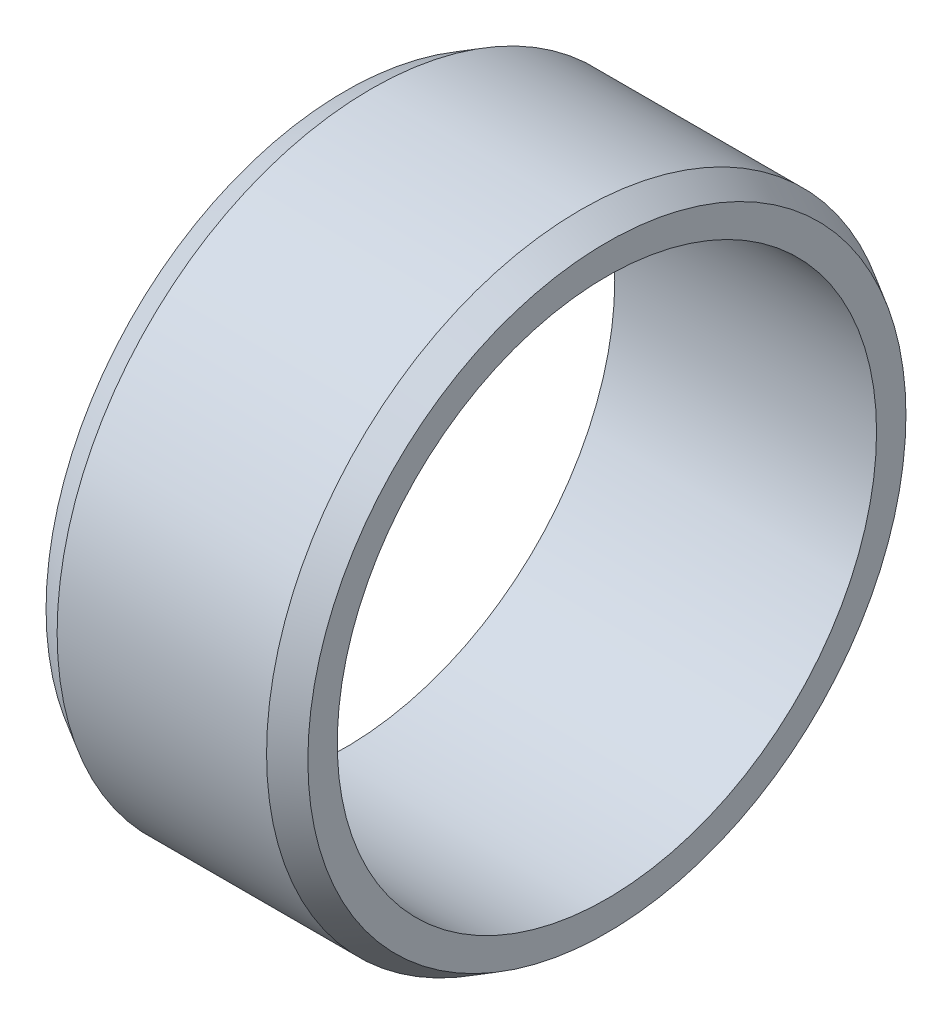
ISO-10303-21;
HEADER;
FILE_DESCRIPTION(('STEP AP214'),'2;1');
FILE_NAME('part.step','',(''),(''),'','','');
FILE_SCHEMA(('AUTOMOTIVE_DESIGN { 1 0 10303 214 1 1 1 1 }'));
ENDSEC;
DATA;
#1=APPLICATION_CONTEXT('core data for automotive mechanical design processes');
#2=APPLICATION_PROTOCOL_DEFINITION('international standard','automotive_design',2000,#1);
#3=PRODUCT_CONTEXT('',#1,'mechanical');
#4=PRODUCT('Part','Part','',(#3));
#5=PRODUCT_RELATED_PRODUCT_CATEGORY('part','',(#4));
#6=PRODUCT_DEFINITION_FORMATION('','',#4);
#7=PRODUCT_DEFINITION_CONTEXT('part definition',#1,'design');
#8=PRODUCT_DEFINITION('design','',#6,#7);
#9=PRODUCT_DEFINITION_SHAPE('','',#8);
#10=(LENGTH_UNIT() NAMED_UNIT(*) SI_UNIT(.MILLI.,.METRE.));
#11=(NAMED_UNIT(*) PLANE_ANGLE_UNIT() SI_UNIT($,.RADIAN.));
#12=(NAMED_UNIT(*) SI_UNIT($,.STERADIAN.) SOLID_ANGLE_UNIT());
#13=UNCERTAINTY_MEASURE_WITH_UNIT(LENGTH_MEASURE(1.E-05),#10,'distance_accuracy_value','');
#14=(GEOMETRIC_REPRESENTATION_CONTEXT(3) GLOBAL_UNCERTAINTY_ASSIGNED_CONTEXT((#13)) GLOBAL_UNIT_ASSIGNED_CONTEXT((#10,
#11,#12)) REPRESENTATION_CONTEXT('',''));
#15=CARTESIAN_POINT('',(0.,0.,0.));
#16=DIRECTION('',(0.,0.,1.));
#17=DIRECTION('',(1.,0.,0.));
#18=AXIS2_PLACEMENT_3D('',#15,#16,#17);
#19=CARTESIAN_POINT('',(0.,5.7113248654052,0.));
#20=DIRECTION('',(-1.,0.,0.));
#21=DIRECTION('',(0.,0.,1.));
#22=AXIS2_PLACEMENT_3D('',#19,#20,#21);
#23=PLANE('',#22);
#24=CARTESIAN_POINT('',(0.,0.,0.));
#25=DIRECTION('',(1.,0.,0.));
#26=DIRECTION('',(0.,0.,-1.));
#27=AXIS2_PLACEMENT_3D('',#24,#25,#26);
#28=CIRCLE('',#27,5.15);
#29=CARTESIAN_POINT('',(0.,0.,-5.15));
#30=VERTEX_POINT('',#29);
#31=EDGE_CURVE('E10',#30,#30,#28,.T.);
#32=ORIENTED_EDGE('',*,*,#31,.T.);
#33=EDGE_LOOP('',(#32));
#34=FACE_BOUND('',#33,.T.);
#35=CARTESIAN_POINT('',(0.,0.,0.));
#36=DIRECTION('',(1.,0.,0.));
#37=DIRECTION('',(0.,0.,-1.));
#38=AXIS2_PLACEMENT_3D('',#35,#36,#37);
#39=CIRCLE('',#38,5.7113248654052);
#40=CARTESIAN_POINT('',(0.,0.,-5.7113248654052));
#41=VERTEX_POINT('',#40);
#42=EDGE_CURVE('E59',#41,#41,#39,.T.);
#43=ORIENTED_EDGE('',*,*,#42,.F.);
#44=EDGE_LOOP('',(#43));
#45=FACE_BOUND('',#44,.T.);
#46=ADVANCED_FACE('F37',(#34,#45),#23,.T.);
#47=CARTESIAN_POINT('',(5.,0.,0.));
#48=DIRECTION('',(1.,0.,0.));
#49=DIRECTION('',(0.,0.,-1.));
#50=AXIS2_PLACEMENT_3D('',#47,#48,#49);
#51=CYLINDRICAL_SURFACE('',#50,5.15);
#52=CARTESIAN_POINT('',(5.,0.,0.));
#53=DIRECTION('',(1.,0.,0.));
#54=DIRECTION('',(0.,0.,-1.));
#55=AXIS2_PLACEMENT_3D('',#52,#53,#54);
#56=CIRCLE('',#55,5.15);
#57=CARTESIAN_POINT('',(5.,0.,-5.15));
#58=VERTEX_POINT('',#57);
#59=EDGE_CURVE('E43',#58,#58,#56,.T.);
#60=ORIENTED_EDGE('',*,*,#59,.T.);
#61=EDGE_LOOP('',(#60));
#62=FACE_BOUND('',#61,.T.);
#63=ORIENTED_EDGE('',*,*,#31,.F.);
#64=EDGE_LOOP('',(#63));
#65=FACE_BOUND('',#64,.T.);
#66=ADVANCED_FACE('F67',(#62,#65),#51,.F.);
#67=CARTESIAN_POINT('',(5.,5.15,0.));
#68=DIRECTION('',(1.,0.,0.));
#69=DIRECTION('',(0.,0.,-1.));
#70=AXIS2_PLACEMENT_3D('',#67,#68,#69);
#71=PLANE('',#70);
#72=CARTESIAN_POINT('',(5.,0.,0.));
#73=DIRECTION('',(1.,0.,0.));
#74=DIRECTION('',(0.,0.,-1.));
#75=AXIS2_PLACEMENT_3D('',#72,#73,#74);
#76=CIRCLE('',#75,5.7113248654052);
#77=CARTESIAN_POINT('',(5.,0.,-5.7113248654052));
#78=VERTEX_POINT('',#77);
#79=EDGE_CURVE('E47',#78,#78,#76,.T.);
#80=ORIENTED_EDGE('',*,*,#79,.T.);
#81=EDGE_LOOP('',(#80));
#82=FACE_BOUND('',#81,.T.);
#83=ORIENTED_EDGE('',*,*,#59,.F.);
#84=EDGE_LOOP('',(#83));
#85=FACE_BOUND('',#84,.T.);
#86=ADVANCED_FACE('F71',(#82,#85),#71,.T.);
#87=CARTESIAN_POINT('',(5.,0.,0.));
#88=DIRECTION('',(-1.,0.,0.));
#89=DIRECTION('',(0.,0.,1.));
#90=AXIS2_PLACEMENT_3D('',#87,#88,#89);
#91=CONICAL_SURFACE('',#90,5.7113248654052,0.52359877559828);
#92=CARTESIAN_POINT('',(4.5,0.,0.));
#93=DIRECTION('',(1.,0.,0.));
#94=DIRECTION('',(0.,0.,-1.));
#95=AXIS2_PLACEMENT_3D('',#92,#93,#94);
#96=CIRCLE('',#95,6.);
#97=CARTESIAN_POINT('',(4.5,0.,-6.));
#98=VERTEX_POINT('',#97);
#99=EDGE_CURVE('E51',#98,#98,#96,.T.);
#100=ORIENTED_EDGE('',*,*,#99,.T.);
#101=EDGE_LOOP('',(#100));
#102=FACE_BOUND('',#101,.T.);
#103=ORIENTED_EDGE('',*,*,#79,.F.);
#104=EDGE_LOOP('',(#103));
#105=FACE_BOUND('',#104,.T.);
#106=ADVANCED_FACE('F75',(#102,#105),#91,.T.);
#107=CARTESIAN_POINT('',(5.,0.,0.));
#108=DIRECTION('',(1.,0.,0.));
#109=DIRECTION('',(0.,0.,-1.));
#110=AXIS2_PLACEMENT_3D('',#107,#108,#109);
#111=CYLINDRICAL_SURFACE('',#110,6.);
#112=CARTESIAN_POINT('',(0.5,0.,0.));
#113=DIRECTION('',(1.,0.,0.));
#114=DIRECTION('',(0.,0.,-1.));
#115=AXIS2_PLACEMENT_3D('',#112,#113,#114);
#116=CIRCLE('',#115,6.);
#117=CARTESIAN_POINT('',(0.5,0.,-6.));
#118=VERTEX_POINT('',#117);
#119=EDGE_CURVE('E56',#118,#118,#116,.T.);
#120=ORIENTED_EDGE('',*,*,#119,.T.);
#121=EDGE_LOOP('',(#120));
#122=FACE_BOUND('',#121,.T.);
#123=ORIENTED_EDGE('',*,*,#99,.F.);
#124=EDGE_LOOP('',(#123));
#125=FACE_BOUND('',#124,.T.);
#126=ADVANCED_FACE('F82',(#122,#125),#111,.T.);
#127=CARTESIAN_POINT('',(0.5,0.,0.));
#128=DIRECTION('',(1.,0.,0.));
#129=DIRECTION('',(0.,0.,-1.));
#130=AXIS2_PLACEMENT_3D('',#127,#128,#129);
#131=CONICAL_SURFACE('',#130,6.,0.52359877559828);
#132=ORIENTED_EDGE('',*,*,#42,.T.);
#133=EDGE_LOOP('',(#132));
#134=FACE_BOUND('',#133,.T.);
#135=ORIENTED_EDGE('',*,*,#119,.F.);
#136=EDGE_LOOP('',(#135));
#137=FACE_BOUND('',#136,.T.);
#138=ADVANCED_FACE('F63',(#134,#137),#131,.T.);
#139=CLOSED_SHELL('',(#46,#66,#86,#106,#126,#138));
#140=MANIFOLD_SOLID_BREP('B2',#139);
#141=ADVANCED_BREP_SHAPE_REPRESENTATION('',(#18,#140),#14);
#142=SHAPE_DEFINITION_REPRESENTATION(#9,#141);
ENDSEC;
END-ISO-10303-21;
